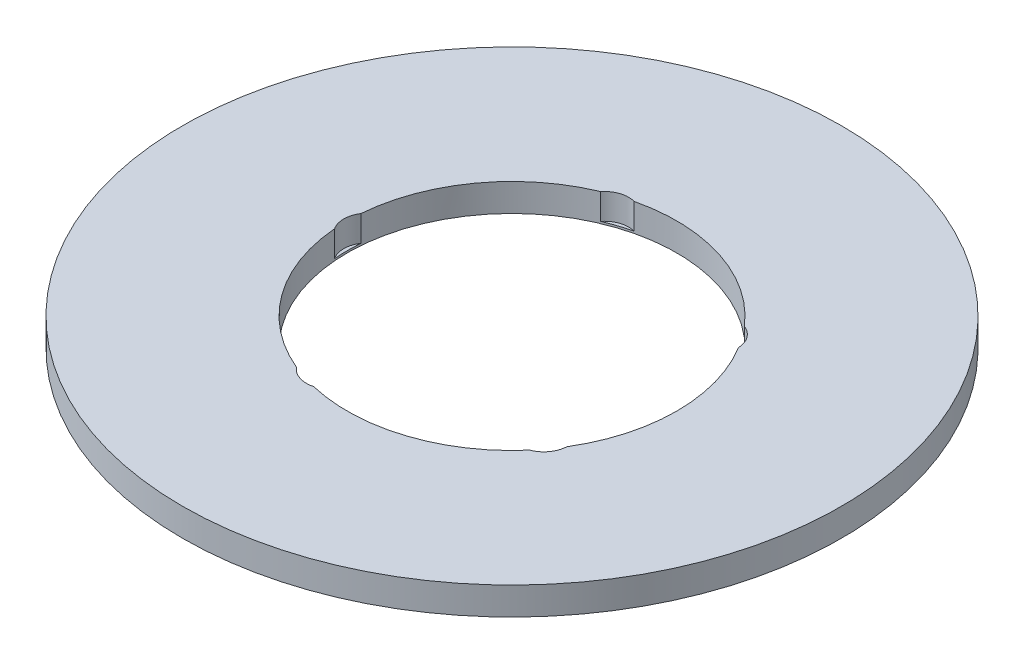
ISO-10303-21;
HEADER;
FILE_DESCRIPTION(('STEP AP214'),'2;1');
FILE_NAME('part.step','',(''),(''),'','','');
FILE_SCHEMA(('AUTOMOTIVE_DESIGN { 1 0 10303 214 1 1 1 1 }'));
ENDSEC;
DATA;
#1=APPLICATION_CONTEXT('core data for automotive mechanical design processes');
#2=APPLICATION_PROTOCOL_DEFINITION('international standard','automotive_design',2000,#1);
#3=PRODUCT_CONTEXT('',#1,'mechanical');
#4=PRODUCT('Part','Part','',(#3));
#5=PRODUCT_RELATED_PRODUCT_CATEGORY('part','',(#4));
#6=PRODUCT_DEFINITION_FORMATION('','',#4);
#7=PRODUCT_DEFINITION_CONTEXT('part definition',#1,'design');
#8=PRODUCT_DEFINITION('design','',#6,#7);
#9=PRODUCT_DEFINITION_SHAPE('','',#8);
#10=(LENGTH_UNIT() NAMED_UNIT(*) SI_UNIT(.MILLI.,.METRE.));
#11=(NAMED_UNIT(*) PLANE_ANGLE_UNIT() SI_UNIT($,.RADIAN.));
#12=(NAMED_UNIT(*) SI_UNIT($,.STERADIAN.) SOLID_ANGLE_UNIT());
#13=UNCERTAINTY_MEASURE_WITH_UNIT(LENGTH_MEASURE(1.E-05),#10,'distance_accuracy_value','');
#14=(GEOMETRIC_REPRESENTATION_CONTEXT(3) GLOBAL_UNCERTAINTY_ASSIGNED_CONTEXT((#13)) GLOBAL_UNIT_ASSIGNED_CONTEXT((#10,
#11,#12)) REPRESENTATION_CONTEXT('',''));
#15=CARTESIAN_POINT('',(0.,0.,0.));
#16=DIRECTION('',(0.,0.,1.));
#17=DIRECTION('',(1.,0.,0.));
#18=AXIS2_PLACEMENT_3D('',#15,#16,#17);
#19=CARTESIAN_POINT('',(0.,8.,0.));
#20=DIRECTION('',(0.,-1.,0.));
#21=DIRECTION('',(0.,0.,-1.));
#22=AXIS2_PLACEMENT_3D('',#19,#20,#21);
#23=CYLINDRICAL_SURFACE('',#22,95.);
#24=CARTESIAN_POINT('',(0.,8.,0.));
#25=DIRECTION('',(0.,1.,0.));
#26=DIRECTION('',(0.,0.,1.));
#27=AXIS2_PLACEMENT_3D('',#24,#25,#26);
#28=CIRCLE('',#27,95.);
#29=CARTESIAN_POINT('',(0.,8.,95.));
#30=VERTEX_POINT('',#29);
#31=EDGE_CURVE('E159',#30,#30,#28,.T.);
#32=ORIENTED_EDGE('',*,*,#31,.F.);
#33=EDGE_LOOP('',(#32));
#34=FACE_BOUND('',#33,.T.);
#35=CARTESIAN_POINT('',(0.,0.,0.));
#36=DIRECTION('',(0.,1.,0.));
#37=DIRECTION('',(0.,0.,1.));
#38=AXIS2_PLACEMENT_3D('',#35,#36,#37);
#39=CIRCLE('',#38,95.);
#40=CARTESIAN_POINT('',(0.,0.,95.));
#41=VERTEX_POINT('',#40);
#42=EDGE_CURVE('E152',#41,#41,#39,.T.);
#43=ORIENTED_EDGE('',*,*,#42,.T.);
#44=EDGE_LOOP('',(#43));
#45=FACE_BOUND('',#44,.T.);
#46=ADVANCED_FACE('F39',(#34,#45),#23,.T.);
#47=CARTESIAN_POINT('',(0.,8.,0.));
#48=DIRECTION('',(0.,1.,0.));
#49=DIRECTION('',(0.,0.,1.));
#50=AXIS2_PLACEMENT_3D('',#47,#48,#49);
#51=PLANE('',#50);
#52=CARTESIAN_POINT('',(-12.8216595852611,8.,39.4610106248238));
#53=DIRECTION('',(0.,1.,0.));
#54=DIRECTION('',(0.951056516295155,0.,0.309016994374945));
#55=AXIS2_PLACEMENT_3D('',#52,#53,#54);
#56=CIRCLE('',#55,6.99152280303914);
#57=CARTESIAN_POINT('',(-18.2658978066111,8.,43.8475424319133));
#58=VERTEX_POINT('',#57);
#59=CARTESIAN_POINT('',(-10.9955170476823,8.,46.209832339602));
#60=VERTEX_POINT('',#59);
#61=EDGE_CURVE('E192',#58,#60,#56,.T.);
#62=ORIENTED_EDGE('',*,*,#61,.F.);
#63=CARTESIAN_POINT('',(0.,8.,0.));
#64=DIRECTION('',(0.,1.,0.));
#65=DIRECTION('',(0.,0.,1.));
#66=AXIS2_PLACEMENT_3D('',#63,#64,#65);
#67=CIRCLE('',#66,47.5);
#68=CARTESIAN_POINT('',(-47.3459637931583,8.,3.82226536192116));
#69=VERTEX_POINT('',#68);
#70=EDGE_CURVE('E147',#69,#58,#67,.T.);
#71=ORIENTED_EDGE('',*,*,#70,.F.);
#72=CARTESIAN_POINT('',(-41.4917620022671,8.,0.));
#73=DIRECTION('',(0.,1.,0.));
#74=DIRECTION('',(0.,0.,1.));
#75=AXIS2_PLACEMENT_3D('',#72,#73,#74);
#76=CIRCLE('',#75,6.99152280303914);
#77=CARTESIAN_POINT('',(-47.3459637931583,8.,-3.82226536192116));
#78=VERTEX_POINT('',#77);
#79=EDGE_CURVE('E154',#78,#69,#76,.T.);
#80=ORIENTED_EDGE('',*,*,#79,.F.);
#81=CARTESIAN_POINT('',(-18.2658978066117,8.,-43.8475424319131));
#82=VERTEX_POINT('',#81);
#83=EDGE_CURVE('E136',#82,#78,#67,.T.);
#84=ORIENTED_EDGE('',*,*,#83,.F.);
#85=CARTESIAN_POINT('',(-12.8216595852617,8.,-39.4610106248236));
#86=DIRECTION('',(0.,1.,0.));
#87=DIRECTION('',(-0.95105651629515,0.,0.309016994374958));
#88=AXIS2_PLACEMENT_3D('',#85,#86,#87);
#89=CIRCLE('',#88,6.99152280303914);
#90=CARTESIAN_POINT('',(-10.995517047683,8.,-46.2098323396019));
#91=VERTEX_POINT('',#90);
#92=EDGE_CURVE('E117',#91,#82,#89,.T.);
#93=ORIENTED_EDGE('',*,*,#92,.F.);
#94=CARTESIAN_POINT('',(36.0570181136401,8.,-30.9215369079971));
#95=VERTEX_POINT('',#94);
#96=EDGE_CURVE('E133',#95,#91,#67,.T.);
#97=ORIENTED_EDGE('',*,*,#96,.F.);
#98=CARTESIAN_POINT('',(33.5675405863946,8.,-24.3882457965621));
#99=DIRECTION('',(0.,1.,0.));
#100=DIRECTION('',(-0.58778525229248,0.,-0.809016994374942));
#101=AXIS2_PLACEMENT_3D('',#98,#99,#100);
#102=CIRCLE('',#101,6.99152280303914);
#103=CARTESIAN_POINT('',(40.5503605338114,8.,-24.7369816383873));
#104=VERTEX_POINT('',#103);
#105=EDGE_CURVE('E333',#104,#95,#102,.T.);
#106=ORIENTED_EDGE('',*,*,#105,.F.);
#107=CARTESIAN_POINT('',(40.5503605338118,8.,24.7369816383867));
#108=VERTEX_POINT('',#107);
#109=EDGE_CURVE('E144',#108,#104,#67,.T.);
#110=ORIENTED_EDGE('',*,*,#109,.F.);
#111=CARTESIAN_POINT('',(33.5675405863949,8.,24.3882457965616));
#112=DIRECTION('',(0.,1.,0.));
#113=DIRECTION('',(0.587785252292469,0.,-0.809016994374951));
#114=AXIS2_PLACEMENT_3D('',#111,#112,#113);
#115=CIRCLE('',#114,6.99152280303914);
#116=CARTESIAN_POINT('',(36.0570181136406,8.,30.9215369079966));
#117=VERTEX_POINT('',#116);
#118=EDGE_CURVE('E328',#117,#108,#115,.T.);
#119=ORIENTED_EDGE('',*,*,#118,.F.);
#120=EDGE_CURVE('E146',#60,#117,#67,.T.);
#121=ORIENTED_EDGE('',*,*,#120,.F.);
#122=EDGE_LOOP('',(#62,#71,#80,#84,#93,#97,#106,#110,#119,#121));
#123=FACE_BOUND('',#122,.T.);
#124=ORIENTED_EDGE('',*,*,#31,.T.);
#125=EDGE_LOOP('',(#124));
#126=FACE_BOUND('',#125,.T.);
#127=ADVANCED_FACE('F131',(#123,#126),#51,.T.);
#128=CARTESIAN_POINT('',(0.,0.,0.));
#129=DIRECTION('',(0.,1.,0.));
#130=DIRECTION('',(0.,0.,1.));
#131=AXIS2_PLACEMENT_3D('',#128,#129,#130);
#132=PLANE('',#131);
#133=CARTESIAN_POINT('',(0.,0.,0.));
#134=DIRECTION('',(0.,1.,0.));
#135=DIRECTION('',(0.,0.,1.));
#136=AXIS2_PLACEMENT_3D('',#133,#134,#135);
#137=CIRCLE('',#136,47.5);
#138=CARTESIAN_POINT('',(0.,0.,47.5));
#139=VERTEX_POINT('',#138);
#140=EDGE_CURVE('E149',#139,#139,#137,.T.);
#141=ORIENTED_EDGE('',*,*,#140,.T.);
#142=EDGE_LOOP('',(#141));
#143=FACE_BOUND('',#142,.T.);
#144=ORIENTED_EDGE('',*,*,#42,.F.);
#145=EDGE_LOOP('',(#144));
#146=FACE_BOUND('',#145,.T.);
#147=ADVANCED_FACE('F209',(#143,#146),#132,.F.);
#148=CARTESIAN_POINT('',(0.,8.,0.));
#149=DIRECTION('',(0.,-1.,0.));
#150=DIRECTION('',(0.,0.,-1.));
#151=AXIS2_PLACEMENT_3D('',#148,#149,#150);
#152=CYLINDRICAL_SURFACE('',#151,47.5);
#153=DIRECTION('',(0.,1.,0.));
#154=VECTOR('',#153,1.);
#155=CARTESIAN_POINT('',(-18.2658978066112,4.28267408178075,43.8475424319133));
#156=LINE('',#155,#154);
#157=CARTESIAN_POINT('',(-18.2658978066111,0.565348163561492,43.8475424319133));
#158=VERTEX_POINT('',#157);
#159=EDGE_CURVE('E11',#158,#58,#156,.T.);
#160=ORIENTED_EDGE('',*,*,#159,.F.);
#161=CARTESIAN_POINT('',(0.,0.565348163561492,0.));
#162=DIRECTION('',(0.,1.,0.));
#163=DIRECTION('',(0.,0.,1.));
#164=AXIS2_PLACEMENT_3D('',#161,#162,#163);
#165=CIRCLE('',#164,47.5);
#166=CARTESIAN_POINT('',(-10.9955170476823,0.565348163561492,46.209832339602));
#167=VERTEX_POINT('',#166);
#168=EDGE_CURVE('E187',#158,#167,#165,.T.);
#169=ORIENTED_EDGE('',*,*,#168,.T.);
#170=DIRECTION('',(0.,1.,0.));
#171=VECTOR('',#170,1.);
#172=CARTESIAN_POINT('',(-10.9955170476823,4.28267408178075,46.209832339602));
#173=LINE('',#172,#171);
#174=EDGE_CURVE('E46',#60,#167,#173,.F.);
#175=ORIENTED_EDGE('',*,*,#174,.F.);
#176=ORIENTED_EDGE('',*,*,#120,.T.);
#177=DIRECTION('',(0.,1.,0.));
#178=VECTOR('',#177,1.);
#179=CARTESIAN_POINT('',(36.0570181136405,4.28267408178075,30.9215369079966));
#180=LINE('',#179,#178);
#181=CARTESIAN_POINT('',(36.0570181136406,0.565348163561492,30.9215369079966));
#182=VERTEX_POINT('',#181);
#183=EDGE_CURVE('E186',#182,#117,#180,.T.);
#184=ORIENTED_EDGE('',*,*,#183,.F.);
#185=CARTESIAN_POINT('',(0.,0.565348163561492,0.));
#186=DIRECTION('',(0.,1.,0.));
#187=DIRECTION('',(0.,0.,1.));
#188=AXIS2_PLACEMENT_3D('',#185,#186,#187);
#189=CIRCLE('',#188,47.5);
#190=CARTESIAN_POINT('',(40.5503605338118,0.565348163561492,24.7369816383867));
#191=VERTEX_POINT('',#190);
#192=EDGE_CURVE('E182',#182,#191,#189,.T.);
#193=ORIENTED_EDGE('',*,*,#192,.T.);
#194=DIRECTION('',(0.,1.,0.));
#195=VECTOR('',#194,1.);
#196=CARTESIAN_POINT('',(40.5503605338118,4.28267408178075,24.7369816383866));
#197=LINE('',#196,#195);
#198=EDGE_CURVE('E184',#108,#191,#197,.F.);
#199=ORIENTED_EDGE('',*,*,#198,.F.);
#200=ORIENTED_EDGE('',*,*,#109,.T.);
#201=DIRECTION('',(0.,1.,0.));
#202=VECTOR('',#201,1.);
#203=CARTESIAN_POINT('',(40.5503605338114,4.28267408178075,-24.7369816383873));
#204=LINE('',#203,#202);
#205=CARTESIAN_POINT('',(40.5503605338114,0.565348163561492,-24.7369816383873));
#206=VERTEX_POINT('',#205);
#207=EDGE_CURVE('E178',#206,#104,#204,.T.);
#208=ORIENTED_EDGE('',*,*,#207,.F.);
#209=CARTESIAN_POINT('',(0.,0.565348163561492,0.));
#210=DIRECTION('',(0.,1.,0.));
#211=DIRECTION('',(0.,0.,1.));
#212=AXIS2_PLACEMENT_3D('',#209,#210,#211);
#213=CIRCLE('',#212,47.5);
#214=CARTESIAN_POINT('',(36.0570181136401,0.565348163561492,-30.9215369079971));
#215=VERTEX_POINT('',#214);
#216=EDGE_CURVE('E123',#206,#215,#213,.T.);
#217=ORIENTED_EDGE('',*,*,#216,.T.);
#218=DIRECTION('',(0.,1.,0.));
#219=VECTOR('',#218,1.);
#220=CARTESIAN_POINT('',(36.0570181136402,4.28267408178075,-30.9215369079971));
#221=LINE('',#220,#219);
#222=EDGE_CURVE('E145',#95,#215,#221,.F.);
#223=ORIENTED_EDGE('',*,*,#222,.F.);
#224=ORIENTED_EDGE('',*,*,#96,.T.);
#225=DIRECTION('',(0.,1.,0.));
#226=VECTOR('',#225,1.);
#227=CARTESIAN_POINT('',(-10.995517047683,4.28267408178075,-46.2098323396019));
#228=LINE('',#227,#226);
#229=CARTESIAN_POINT('',(-10.995517047683,0.565348163561492,-46.2098323396019));
#230=VERTEX_POINT('',#229);
#231=EDGE_CURVE('E111',#230,#91,#228,.T.);
#232=ORIENTED_EDGE('',*,*,#231,.F.);
#233=CARTESIAN_POINT('',(0.,0.565348163561492,0.));
#234=DIRECTION('',(0.,1.,0.));
#235=DIRECTION('',(0.,0.,1.));
#236=AXIS2_PLACEMENT_3D('',#233,#234,#235);
#237=CIRCLE('',#236,47.5);
#238=CARTESIAN_POINT('',(-18.2658978066117,0.565348163561492,-43.8475424319131));
#239=VERTEX_POINT('',#238);
#240=EDGE_CURVE('E173',#230,#239,#237,.T.);
#241=ORIENTED_EDGE('',*,*,#240,.T.);
#242=DIRECTION('',(0.,1.,0.));
#243=VECTOR('',#242,1.);
#244=CARTESIAN_POINT('',(-18.2658978066117,4.28267408178075,-43.8475424319131));
#245=LINE('',#244,#243);
#246=EDGE_CURVE('E124',#82,#239,#245,.F.);
#247=ORIENTED_EDGE('',*,*,#246,.F.);
#248=ORIENTED_EDGE('',*,*,#83,.T.);
#249=DIRECTION('',(0.,1.,0.));
#250=VECTOR('',#249,1.);
#251=CARTESIAN_POINT('',(-47.3459637931583,4.28267408178075,-3.82226536192115));
#252=LINE('',#251,#250);
#253=CARTESIAN_POINT('',(-47.3459637931583,0.565348163561492,-3.82226536192116));
#254=VERTEX_POINT('',#253);
#255=EDGE_CURVE('E171',#254,#78,#252,.T.);
#256=ORIENTED_EDGE('',*,*,#255,.F.);
#257=CARTESIAN_POINT('',(0.,0.565348163561492,0.));
#258=DIRECTION('',(0.,1.,0.));
#259=DIRECTION('',(0.,0.,1.));
#260=AXIS2_PLACEMENT_3D('',#257,#258,#259);
#261=CIRCLE('',#260,47.5);
#262=CARTESIAN_POINT('',(-47.3459637931583,0.565348163561492,3.82226536192116));
#263=VERTEX_POINT('',#262);
#264=EDGE_CURVE('E162',#254,#263,#261,.T.);
#265=ORIENTED_EDGE('',*,*,#264,.T.);
#266=DIRECTION('',(0.,1.,0.));
#267=VECTOR('',#266,1.);
#268=CARTESIAN_POINT('',(-47.3459637931583,4.28267408178075,3.82226536192115));
#269=LINE('',#268,#267);
#270=EDGE_CURVE('E169',#69,#263,#269,.F.);
#271=ORIENTED_EDGE('',*,*,#270,.F.);
#272=ORIENTED_EDGE('',*,*,#70,.T.);
#273=EDGE_LOOP('',(#160,#169,#175,#176,#184,#193,#199,#200,#208,#217,#223,#224,#232,#241,#247,
#248,#256,#265,#271,#272));
#274=FACE_BOUND('',#273,.T.);
#275=ORIENTED_EDGE('',*,*,#140,.F.);
#276=EDGE_LOOP('',(#275));
#277=FACE_BOUND('',#276,.T.);
#278=ADVANCED_FACE('F139',(#274,#277),#152,.F.);
#279=CARTESIAN_POINT('',(-41.4917620022671,0.565348163561492,0.));
#280=DIRECTION('',(0.,1.,0.));
#281=DIRECTION('',(0.,0.,1.));
#282=AXIS2_PLACEMENT_3D('',#279,#280,#281);
#283=CYLINDRICAL_SURFACE('',#282,6.99152280303914);
#284=ORIENTED_EDGE('',*,*,#255,.T.);
#285=ORIENTED_EDGE('',*,*,#79,.T.);
#286=ORIENTED_EDGE('',*,*,#270,.T.);
#287=CARTESIAN_POINT('',(-41.4917620022671,0.565348163561492,0.));
#288=DIRECTION('',(0.,1.,0.));
#289=DIRECTION('',(0.,0.,1.));
#290=AXIS2_PLACEMENT_3D('',#287,#288,#289);
#291=CIRCLE('',#290,6.99152280303914);
#292=EDGE_CURVE('E157',#254,#263,#291,.T.);
#293=ORIENTED_EDGE('',*,*,#292,.F.);
#294=EDGE_LOOP('',(#284,#285,#286,#293));
#295=FACE_BOUND('',#294,.T.);
#296=ADVANCED_FACE('F222',(#295),#283,.F.);
#297=CARTESIAN_POINT('',(-41.4917620022671,0.565348163561492,0.));
#298=DIRECTION('',(0.,1.,0.));
#299=DIRECTION('',(0.,0.,1.));
#300=AXIS2_PLACEMENT_3D('',#297,#298,#299);
#301=PLANE('',#300);
#302=ORIENTED_EDGE('',*,*,#292,.T.);
#303=ORIENTED_EDGE('',*,*,#264,.F.);
#304=EDGE_LOOP('',(#302,#303));
#305=FACE_BOUND('',#304,.T.);
#306=ADVANCED_FACE('F223',(#305),#301,.T.);
#307=CARTESIAN_POINT('',(-12.8216595852617,0.565348163561492,-39.4610106248236));
#308=DIRECTION('',(0.,1.,0.));
#309=DIRECTION('',(0.,0.,1.));
#310=AXIS2_PLACEMENT_3D('',#307,#308,#309);
#311=CYLINDRICAL_SURFACE('',#310,6.99152280303914);
#312=ORIENTED_EDGE('',*,*,#231,.T.);
#313=ORIENTED_EDGE('',*,*,#92,.T.);
#314=ORIENTED_EDGE('',*,*,#246,.T.);
#315=CARTESIAN_POINT('',(-12.8216595852617,0.565348163561492,-39.4610106248236));
#316=DIRECTION('',(0.,1.,0.));
#317=DIRECTION('',(-0.95105651629515,0.,0.309016994374958));
#318=AXIS2_PLACEMENT_3D('',#315,#316,#317);
#319=CIRCLE('',#318,6.99152280303914);
#320=EDGE_CURVE('E119',#230,#239,#319,.T.);
#321=ORIENTED_EDGE('',*,*,#320,.F.);
#322=EDGE_LOOP('',(#312,#313,#314,#321));
#323=FACE_BOUND('',#322,.T.);
#324=ADVANCED_FACE('F116',(#323),#311,.F.);
#325=CARTESIAN_POINT('',(-12.8216595852617,0.565348163561492,-39.4610106248236));
#326=DIRECTION('',(0.,1.,0.));
#327=DIRECTION('',(-0.95105651629515,0.,0.309016994374958));
#328=AXIS2_PLACEMENT_3D('',#325,#326,#327);
#329=PLANE('',#328);
#330=ORIENTED_EDGE('',*,*,#320,.T.);
#331=ORIENTED_EDGE('',*,*,#240,.F.);
#332=EDGE_LOOP('',(#330,#331));
#333=FACE_BOUND('',#332,.T.);
#334=ADVANCED_FACE('F235',(#333),#329,.T.);
#335=CARTESIAN_POINT('',(33.5675405863946,0.565348163561492,-24.3882457965621));
#336=DIRECTION('',(0.,1.,0.));
#337=DIRECTION('',(0.,0.,1.));
#338=AXIS2_PLACEMENT_3D('',#335,#336,#337);
#339=CYLINDRICAL_SURFACE('',#338,6.99152280303914);
#340=ORIENTED_EDGE('',*,*,#207,.T.);
#341=ORIENTED_EDGE('',*,*,#105,.T.);
#342=ORIENTED_EDGE('',*,*,#222,.T.);
#343=CARTESIAN_POINT('',(33.5675405863946,0.565348163561492,-24.3882457965621));
#344=DIRECTION('',(0.,1.,0.));
#345=DIRECTION('',(-0.58778525229248,0.,-0.809016994374942));
#346=AXIS2_PLACEMENT_3D('',#343,#344,#345);
#347=CIRCLE('',#346,6.99152280303914);
#348=EDGE_CURVE('E335',#206,#215,#347,.T.);
#349=ORIENTED_EDGE('',*,*,#348,.F.);
#350=EDGE_LOOP('',(#340,#341,#342,#349));
#351=FACE_BOUND('',#350,.T.);
#352=ADVANCED_FACE('F234',(#351),#339,.F.);
#353=CARTESIAN_POINT('',(33.5675405863946,0.565348163561492,-24.3882457965621));
#354=DIRECTION('',(0.,1.,0.));
#355=DIRECTION('',(-0.58778525229248,0.,-0.809016994374942));
#356=AXIS2_PLACEMENT_3D('',#353,#354,#355);
#357=PLANE('',#356);
#358=ORIENTED_EDGE('',*,*,#348,.T.);
#359=ORIENTED_EDGE('',*,*,#216,.F.);
#360=EDGE_LOOP('',(#358,#359));
#361=FACE_BOUND('',#360,.T.);
#362=ADVANCED_FACE('F239',(#361),#357,.T.);
#363=CARTESIAN_POINT('',(33.5675405863949,0.565348163561492,24.3882457965616));
#364=DIRECTION('',(0.,1.,0.));
#365=DIRECTION('',(0.,0.,1.));
#366=AXIS2_PLACEMENT_3D('',#363,#364,#365);
#367=CYLINDRICAL_SURFACE('',#366,6.99152280303914);
#368=ORIENTED_EDGE('',*,*,#183,.T.);
#369=ORIENTED_EDGE('',*,*,#118,.T.);
#370=ORIENTED_EDGE('',*,*,#198,.T.);
#371=CARTESIAN_POINT('',(33.5675405863949,0.565348163561492,24.3882457965616));
#372=DIRECTION('',(0.,1.,0.));
#373=DIRECTION('',(0.587785252292469,0.,-0.809016994374951));
#374=AXIS2_PLACEMENT_3D('',#371,#372,#373);
#375=CIRCLE('',#374,6.99152280303914);
#376=EDGE_CURVE('E56',#182,#191,#375,.T.);
#377=ORIENTED_EDGE('',*,*,#376,.F.);
#378=EDGE_LOOP('',(#368,#369,#370,#377));
#379=FACE_BOUND('',#378,.T.);
#380=ADVANCED_FACE('F242',(#379),#367,.F.);
#381=CARTESIAN_POINT('',(33.5675405863949,0.565348163561492,24.3882457965616));
#382=DIRECTION('',(0.,1.,0.));
#383=DIRECTION('',(0.587785252292469,0.,-0.809016994374951));
#384=AXIS2_PLACEMENT_3D('',#381,#382,#383);
#385=PLANE('',#384);
#386=ORIENTED_EDGE('',*,*,#376,.T.);
#387=ORIENTED_EDGE('',*,*,#192,.F.);
#388=EDGE_LOOP('',(#386,#387));
#389=FACE_BOUND('',#388,.T.);
#390=ADVANCED_FACE('F205',(#389),#385,.T.);
#391=CARTESIAN_POINT('',(-12.8216595852611,0.565348163561492,39.4610106248238));
#392=DIRECTION('',(0.,1.,0.));
#393=DIRECTION('',(0.,0.,1.));
#394=AXIS2_PLACEMENT_3D('',#391,#392,#393);
#395=CYLINDRICAL_SURFACE('',#394,6.99152280303914);
#396=ORIENTED_EDGE('',*,*,#159,.T.);
#397=ORIENTED_EDGE('',*,*,#61,.T.);
#398=ORIENTED_EDGE('',*,*,#174,.T.);
#399=CARTESIAN_POINT('',(-12.8216595852611,0.565348163561492,39.4610106248238));
#400=DIRECTION('',(0.,1.,0.));
#401=DIRECTION('',(0.951056516295155,0.,0.309016994374945));
#402=AXIS2_PLACEMENT_3D('',#399,#400,#401);
#403=CIRCLE('',#402,6.99152280303914);
#404=EDGE_CURVE('E55',#158,#167,#403,.T.);
#405=ORIENTED_EDGE('',*,*,#404,.F.);
#406=EDGE_LOOP('',(#396,#397,#398,#405));
#407=FACE_BOUND('',#406,.T.);
#408=ADVANCED_FACE('F195',(#407),#395,.F.);
#409=CARTESIAN_POINT('',(-12.8216595852611,0.565348163561492,39.4610106248238));
#410=DIRECTION('',(0.,1.,0.));
#411=DIRECTION('',(0.951056516295155,0.,0.309016994374945));
#412=AXIS2_PLACEMENT_3D('',#409,#410,#411);
#413=PLANE('',#412);
#414=ORIENTED_EDGE('',*,*,#404,.T.);
#415=ORIENTED_EDGE('',*,*,#168,.F.);
#416=EDGE_LOOP('',(#414,#415));
#417=FACE_BOUND('',#416,.T.);
#418=ADVANCED_FACE('F198',(#417),#413,.T.);
#419=CLOSED_SHELL('',(#46,#127,#147,#278,#296,#306,#324,#334,#352,#362,#380,#390,#408,#418));
#420=MANIFOLD_SOLID_BREP('B2',#419);
#421=ADVANCED_BREP_SHAPE_REPRESENTATION('',(#18,#420),#14);
#422=SHAPE_DEFINITION_REPRESENTATION(#9,#421);
ENDSEC;
END-ISO-10303-21;
